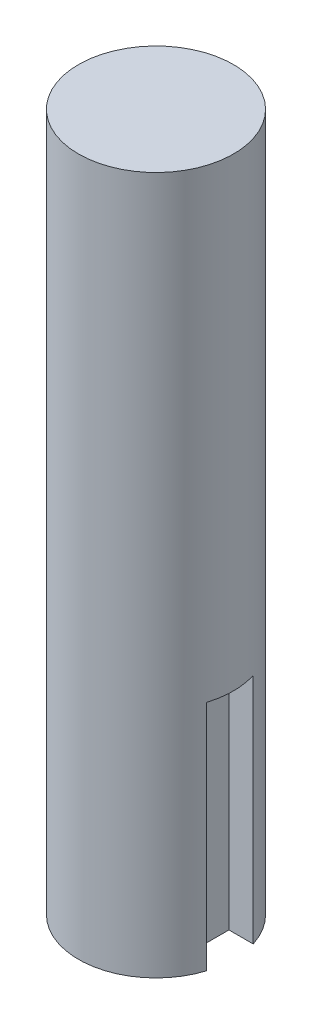
ISO-10303-21;
HEADER;
FILE_DESCRIPTION(('STEP AP214'),'2;1');
FILE_NAME('part.step','',(''),(''),'','','');
FILE_SCHEMA(('AUTOMOTIVE_DESIGN { 1 0 10303 214 1 1 1 1 }'));
ENDSEC;
DATA;
#1=APPLICATION_CONTEXT('core data for automotive mechanical design processes');
#2=APPLICATION_PROTOCOL_DEFINITION('international standard','automotive_design',2000,#1);
#3=PRODUCT_CONTEXT('',#1,'mechanical');
#4=PRODUCT('Part','Part','',(#3));
#5=PRODUCT_RELATED_PRODUCT_CATEGORY('part','',(#4));
#6=PRODUCT_DEFINITION_FORMATION('','',#4);
#7=PRODUCT_DEFINITION_CONTEXT('part definition',#1,'design');
#8=PRODUCT_DEFINITION('design','',#6,#7);
#9=PRODUCT_DEFINITION_SHAPE('','',#8);
#10=(LENGTH_UNIT() NAMED_UNIT(*) SI_UNIT(.MILLI.,.METRE.));
#11=(NAMED_UNIT(*) PLANE_ANGLE_UNIT() SI_UNIT($,.RADIAN.));
#12=(NAMED_UNIT(*) SI_UNIT($,.STERADIAN.) SOLID_ANGLE_UNIT());
#13=UNCERTAINTY_MEASURE_WITH_UNIT(LENGTH_MEASURE(1.E-05),#10,'distance_accuracy_value','');
#14=(GEOMETRIC_REPRESENTATION_CONTEXT(3) GLOBAL_UNCERTAINTY_ASSIGNED_CONTEXT((#13)) GLOBAL_UNIT_ASSIGNED_CONTEXT((#10,
#11,#12)) REPRESENTATION_CONTEXT('',''));
#15=CARTESIAN_POINT('',(0.,0.,0.));
#16=DIRECTION('',(0.,0.,1.));
#17=DIRECTION('',(1.,0.,0.));
#18=AXIS2_PLACEMENT_3D('',#15,#16,#17);
#19=CARTESIAN_POINT('',(0.,90.,0.));
#20=DIRECTION('',(0.,-1.,0.));
#21=DIRECTION('',(0.,0.,-1.));
#22=AXIS2_PLACEMENT_3D('',#19,#20,#21);
#23=CYLINDRICAL_SURFACE('',#22,10.);
#24=CARTESIAN_POINT('',(0.,90.,0.));
#25=DIRECTION('',(0.,1.,0.));
#26=DIRECTION('',(0.,0.,1.));
#27=AXIS2_PLACEMENT_3D('',#24,#25,#26);
#28=CIRCLE('',#27,10.);
#29=CARTESIAN_POINT('',(0.,90.,10.));
#30=VERTEX_POINT('',#29);
#31=EDGE_CURVE('E11',#30,#30,#28,.T.);
#32=ORIENTED_EDGE('',*,*,#31,.F.);
#33=EDGE_LOOP('',(#32));
#34=FACE_BOUND('',#33,.T.);
#35=DIRECTION('',(0.,-1.,0.));
#36=VECTOR('',#35,1.);
#37=CARTESIAN_POINT('',(9.53939201416946,30.,3.));
#38=LINE('',#37,#36);
#39=CARTESIAN_POINT('',(9.53939201416946,30.,3.));
#40=VERTEX_POINT('',#39);
#41=CARTESIAN_POINT('',(9.53939201416946,0.,3.));
#42=VERTEX_POINT('',#41);
#43=EDGE_CURVE('E101',#40,#42,#38,.T.);
#44=ORIENTED_EDGE('',*,*,#43,.F.);
#45=CARTESIAN_POINT('',(0.,30.,0.));
#46=DIRECTION('',(0.,1.,0.));
#47=DIRECTION('',(0.,0.,1.));
#48=AXIS2_PLACEMENT_3D('',#45,#46,#47);
#49=CIRCLE('',#48,10.);
#50=CARTESIAN_POINT('',(9.53939201416946,30.,-3.));
#51=VERTEX_POINT('',#50);
#52=EDGE_CURVE('E88',#40,#51,#49,.T.);
#53=ORIENTED_EDGE('',*,*,#52,.T.);
#54=DIRECTION('',(0.,-1.,0.));
#55=VECTOR('',#54,1.);
#56=CARTESIAN_POINT('',(9.53939201416946,30.,-3.));
#57=LINE('',#56,#55);
#58=CARTESIAN_POINT('',(9.53939201416946,0.,-3.));
#59=VERTEX_POINT('',#58);
#60=EDGE_CURVE('E92',#51,#59,#57,.T.);
#61=ORIENTED_EDGE('',*,*,#60,.T.);
#62=CARTESIAN_POINT('',(0.,0.,0.));
#63=DIRECTION('',(0.,1.,0.));
#64=DIRECTION('',(0.,0.,1.));
#65=AXIS2_PLACEMENT_3D('',#62,#63,#64);
#66=CIRCLE('',#65,10.);
#67=EDGE_CURVE('E46',#59,#42,#66,.T.);
#68=ORIENTED_EDGE('',*,*,#67,.T.);
#69=EDGE_LOOP('',(#44,#53,#61,#68));
#70=FACE_BOUND('',#69,.T.);
#71=ADVANCED_FACE('F43',(#34,#70),#23,.T.);
#72=CARTESIAN_POINT('',(0.,0.,0.));
#73=DIRECTION('',(0.,1.,0.));
#74=DIRECTION('',(0.,0.,1.));
#75=AXIS2_PLACEMENT_3D('',#72,#73,#74);
#76=PLANE('',#75);
#77=DIRECTION('',(1.,0.,0.));
#78=VECTOR('',#77,1.);
#79=CARTESIAN_POINT('',(0.,0.,3.));
#80=LINE('',#79,#78);
#81=CARTESIAN_POINT('',(6.40939201416946,0.,3.));
#82=VERTEX_POINT('',#81);
#83=EDGE_CURVE('E58',#82,#42,#80,.T.);
#84=ORIENTED_EDGE('',*,*,#83,.T.);
#85=ORIENTED_EDGE('',*,*,#67,.F.);
#86=DIRECTION('',(1.,0.,0.));
#87=VECTOR('',#86,1.);
#88=CARTESIAN_POINT('',(0.,0.,-3.));
#89=LINE('',#88,#87);
#90=CARTESIAN_POINT('',(6.40939201416946,0.,-3.));
#91=VERTEX_POINT('',#90);
#92=EDGE_CURVE('E96',#91,#59,#89,.T.);
#93=ORIENTED_EDGE('',*,*,#92,.F.);
#94=DIRECTION('',(0.,0.,1.));
#95=VECTOR('',#94,1.);
#96=CARTESIAN_POINT('',(6.40939201416946,0.,0.));
#97=LINE('',#96,#95);
#98=EDGE_CURVE('E111',#91,#82,#97,.T.);
#99=ORIENTED_EDGE('',*,*,#98,.T.);
#100=EDGE_LOOP('',(#84,#85,#93,#99));
#101=FACE_BOUND('',#100,.T.);
#102=ADVANCED_FACE('F131',(#101),#76,.F.);
#103=CARTESIAN_POINT('',(0.,90.,0.));
#104=DIRECTION('',(0.,1.,0.));
#105=DIRECTION('',(0.,0.,1.));
#106=AXIS2_PLACEMENT_3D('',#103,#104,#105);
#107=PLANE('',#106);
#108=ORIENTED_EDGE('',*,*,#31,.T.);
#109=EDGE_LOOP('',(#108));
#110=FACE_BOUND('',#109,.T.);
#111=ADVANCED_FACE('F135',(#110),#107,.T.);
#112=CARTESIAN_POINT('',(0.,30.,3.));
#113=DIRECTION('',(0.,0.,-1.));
#114=DIRECTION('',(-1.,0.,0.));
#115=AXIS2_PLACEMENT_3D('',#112,#113,#114);
#116=PLANE('',#115);
#117=ORIENTED_EDGE('',*,*,#83,.F.);
#118=DIRECTION('',(0.,-1.,0.));
#119=VECTOR('',#118,1.);
#120=CARTESIAN_POINT('',(6.40939201416946,30.,3.));
#121=LINE('',#120,#119);
#122=CARTESIAN_POINT('',(6.40939201416946,30.,3.));
#123=VERTEX_POINT('',#122);
#124=EDGE_CURVE('E116',#123,#82,#121,.T.);
#125=ORIENTED_EDGE('',*,*,#124,.F.);
#126=DIRECTION('',(1.,0.,0.));
#127=VECTOR('',#126,1.);
#128=CARTESIAN_POINT('',(0.,30.,3.));
#129=LINE('',#128,#127);
#130=EDGE_CURVE('E108',#123,#40,#129,.T.);
#131=ORIENTED_EDGE('',*,*,#130,.T.);
#132=ORIENTED_EDGE('',*,*,#43,.T.);
#133=EDGE_LOOP('',(#117,#125,#131,#132));
#134=FACE_BOUND('',#133,.T.);
#135=ADVANCED_FACE('F133',(#134),#116,.T.);
#136=CARTESIAN_POINT('',(0.,30.,-3.));
#137=DIRECTION('',(0.,0.,-1.));
#138=DIRECTION('',(-1.,0.,0.));
#139=AXIS2_PLACEMENT_3D('',#136,#137,#138);
#140=PLANE('',#139);
#141=ORIENTED_EDGE('',*,*,#92,.T.);
#142=ORIENTED_EDGE('',*,*,#60,.F.);
#143=DIRECTION('',(1.,0.,0.));
#144=VECTOR('',#143,1.);
#145=CARTESIAN_POINT('',(0.,30.,-3.));
#146=LINE('',#145,#144);
#147=CARTESIAN_POINT('',(6.40939201416946,30.,-3.));
#148=VERTEX_POINT('',#147);
#149=EDGE_CURVE('E94',#148,#51,#146,.T.);
#150=ORIENTED_EDGE('',*,*,#149,.F.);
#151=DIRECTION('',(0.,-1.,0.));
#152=VECTOR('',#151,1.);
#153=CARTESIAN_POINT('',(6.40939201416946,30.,-3.));
#154=LINE('',#153,#152);
#155=EDGE_CURVE('E80',#148,#91,#154,.T.);
#156=ORIENTED_EDGE('',*,*,#155,.T.);
#157=EDGE_LOOP('',(#141,#142,#150,#156));
#158=FACE_BOUND('',#157,.T.);
#159=ADVANCED_FACE('F93',(#158),#140,.F.);
#160=CARTESIAN_POINT('',(6.40939201416946,30.,0.));
#161=DIRECTION('',(1.,0.,0.));
#162=DIRECTION('',(0.,0.,-1.));
#163=AXIS2_PLACEMENT_3D('',#160,#161,#162);
#164=PLANE('',#163);
#165=ORIENTED_EDGE('',*,*,#98,.F.);
#166=ORIENTED_EDGE('',*,*,#155,.F.);
#167=DIRECTION('',(0.,0.,1.));
#168=VECTOR('',#167,1.);
#169=CARTESIAN_POINT('',(6.40939201416946,30.,0.));
#170=LINE('',#169,#168);
#171=EDGE_CURVE('E66',#148,#123,#170,.T.);
#172=ORIENTED_EDGE('',*,*,#171,.T.);
#173=ORIENTED_EDGE('',*,*,#124,.T.);
#174=EDGE_LOOP('',(#165,#166,#172,#173));
#175=FACE_BOUND('',#174,.T.);
#176=ADVANCED_FACE('F132',(#175),#164,.T.);
#177=CARTESIAN_POINT('',(0.,30.,0.));
#178=DIRECTION('',(0.,1.,0.));
#179=DIRECTION('',(0.,0.,1.));
#180=AXIS2_PLACEMENT_3D('',#177,#178,#179);
#181=PLANE('',#180);
#182=ORIENTED_EDGE('',*,*,#130,.F.);
#183=ORIENTED_EDGE('',*,*,#171,.F.);
#184=ORIENTED_EDGE('',*,*,#149,.T.);
#185=ORIENTED_EDGE('',*,*,#52,.F.);
#186=EDGE_LOOP('',(#182,#183,#184,#185));
#187=FACE_BOUND('',#186,.T.);
#188=ADVANCED_FACE('F103',(#187),#181,.F.);
#189=CLOSED_SHELL('',(#71,#102,#111,#135,#159,#176,#188));
#190=MANIFOLD_SOLID_BREP('B2',#189);
#191=ADVANCED_BREP_SHAPE_REPRESENTATION('',(#18,#190),#14);
#192=SHAPE_DEFINITION_REPRESENTATION(#9,#191);
ENDSEC;
END-ISO-10303-21;
